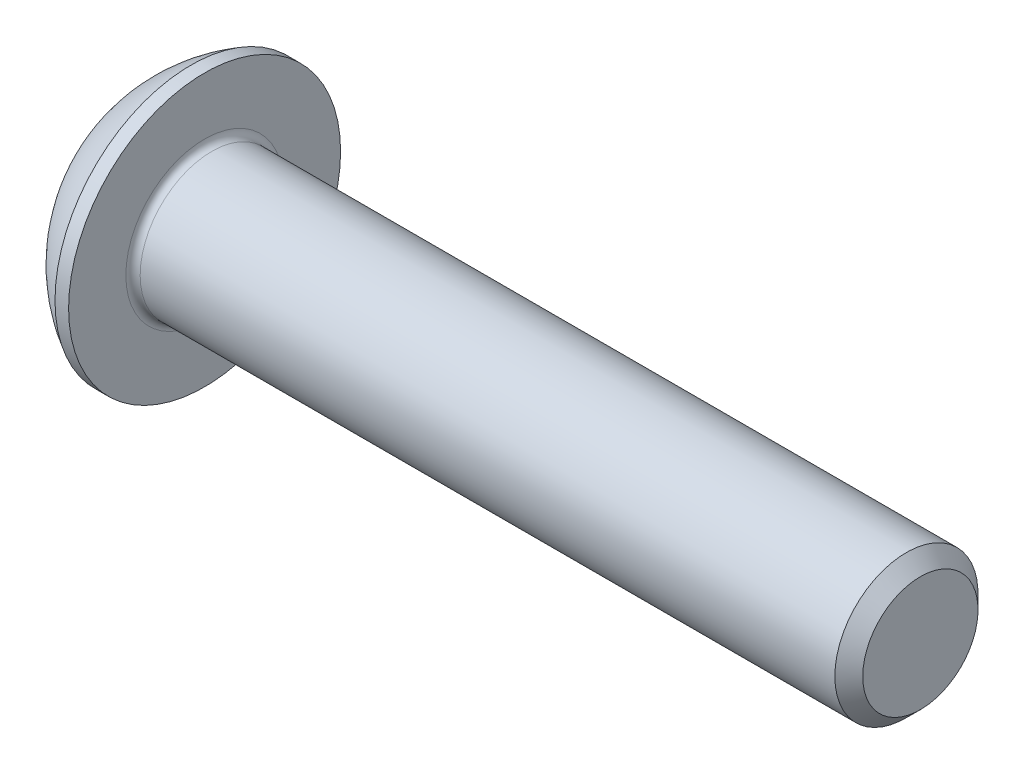
ISO-10303-21;
HEADER;
FILE_DESCRIPTION(('STEP AP214'),'2;1');
FILE_NAME('part.step','',(''),(''),'','','');
FILE_SCHEMA(('AUTOMOTIVE_DESIGN { 1 0 10303 214 1 1 1 1 }'));
ENDSEC;
DATA;
#1=APPLICATION_CONTEXT('core data for automotive mechanical design processes');
#2=APPLICATION_PROTOCOL_DEFINITION('international standard','automotive_design',2000,#1);
#3=PRODUCT_CONTEXT('',#1,'mechanical');
#4=PRODUCT('Part','Part','',(#3));
#5=PRODUCT_RELATED_PRODUCT_CATEGORY('part','',(#4));
#6=PRODUCT_DEFINITION_FORMATION('','',#4);
#7=PRODUCT_DEFINITION_CONTEXT('part definition',#1,'design');
#8=PRODUCT_DEFINITION('design','',#6,#7);
#9=PRODUCT_DEFINITION_SHAPE('','',#8);
#10=(LENGTH_UNIT() NAMED_UNIT(*) SI_UNIT(.MILLI.,.METRE.));
#11=(NAMED_UNIT(*) PLANE_ANGLE_UNIT() SI_UNIT($,.RADIAN.));
#12=(NAMED_UNIT(*) SI_UNIT($,.STERADIAN.) SOLID_ANGLE_UNIT());
#13=UNCERTAINTY_MEASURE_WITH_UNIT(LENGTH_MEASURE(1.E-05),#10,'distance_accuracy_value','');
#14=(GEOMETRIC_REPRESENTATION_CONTEXT(3) GLOBAL_UNCERTAINTY_ASSIGNED_CONTEXT((#13)) GLOBAL_UNIT_ASSIGNED_CONTEXT((#10,
#11,#12)) REPRESENTATION_CONTEXT('',''));
#15=CARTESIAN_POINT('',(0.,0.,0.));
#16=DIRECTION('',(0.,0.,1.));
#17=DIRECTION('',(1.,0.,0.));
#18=AXIS2_PLACEMENT_3D('',#15,#16,#17);
#19=CARTESIAN_POINT('',(0.,0.,0.));
#20=DIRECTION('',(-1.,0.,0.));
#21=DIRECTION('',(0.,0.,1.));
#22=AXIS2_PLACEMENT_3D('',#19,#20,#21);
#23=PLANE('',#22);
#24=CARTESIAN_POINT('',(0.,0.,0.));
#25=DIRECTION('',(-1.,0.,0.));
#26=DIRECTION('',(0.,0.,1.));
#27=AXIS2_PLACEMENT_3D('',#24,#25,#26);
#28=CIRCLE('',#27,1.9);
#29=CARTESIAN_POINT('',(0.,0.,1.9));
#30=VERTEX_POINT('',#29);
#31=EDGE_CURVE('E153',#30,#30,#28,.T.);
#32=ORIENTED_EDGE('',*,*,#31,.T.);
#33=EDGE_LOOP('',(#32));
#34=FACE_BOUND('',#33,.T.);
#35=DIRECTION('',(0.,-1.,0.));
#36=VECTOR('',#35,1.);
#37=CARTESIAN_POINT('',(0.,-0.721687836487032,1.25));
#38=LINE('',#37,#36);
#39=CARTESIAN_POINT('',(0.,0.721687836487034,1.25));
#40=VERTEX_POINT('',#39);
#41=CARTESIAN_POINT('',(0.,-0.721687836487032,1.25));
#42=VERTEX_POINT('',#41);
#43=EDGE_CURVE('E48',#40,#42,#38,.T.);
#44=ORIENTED_EDGE('',*,*,#43,.T.);
#45=DIRECTION('',(0.,-0.499999999999999,-0.866025403784439));
#46=VECTOR('',#45,1.);
#47=CARTESIAN_POINT('',(0.,-1.44337567297406,0.));
#48=LINE('',#47,#46);
#49=CARTESIAN_POINT('',(0.,-1.44337567297406,0.));
#50=VERTEX_POINT('',#49);
#51=EDGE_CURVE('E273',#42,#50,#48,.T.);
#52=ORIENTED_EDGE('',*,*,#51,.T.);
#53=DIRECTION('',(0.,0.499999999999999,-0.866025403784439));
#54=VECTOR('',#53,1.);
#55=CARTESIAN_POINT('',(0.,-0.721687836487033,-1.25));
#56=LINE('',#55,#54);
#57=CARTESIAN_POINT('',(0.,-0.721687836487033,-1.25));
#58=VERTEX_POINT('',#57);
#59=EDGE_CURVE('E128',#50,#58,#56,.T.);
#60=ORIENTED_EDGE('',*,*,#59,.T.);
#61=DIRECTION('',(0.,1.,0.));
#62=VECTOR('',#61,1.);
#63=CARTESIAN_POINT('',(0.,0.721687836487034,-1.25));
#64=LINE('',#63,#62);
#65=CARTESIAN_POINT('',(0.,0.721687836487034,-1.25));
#66=VERTEX_POINT('',#65);
#67=EDGE_CURVE('E276',#58,#66,#64,.T.);
#68=ORIENTED_EDGE('',*,*,#67,.T.);
#69=DIRECTION('',(0.,0.5,0.866025403784439));
#70=VECTOR('',#69,1.);
#71=CARTESIAN_POINT('',(0.,1.44337567297407,0.));
#72=LINE('',#71,#70);
#73=CARTESIAN_POINT('',(0.,1.44337567297407,0.));
#74=VERTEX_POINT('',#73);
#75=EDGE_CURVE('E278',#66,#74,#72,.T.);
#76=ORIENTED_EDGE('',*,*,#75,.T.);
#77=DIRECTION('',(0.,-0.499999999999999,0.866025403784439));
#78=VECTOR('',#77,1.);
#79=CARTESIAN_POINT('',(0.,0.721687836487034,1.25));
#80=LINE('',#79,#78);
#81=EDGE_CURVE('E280',#74,#40,#80,.T.);
#82=ORIENTED_EDGE('',*,*,#81,.T.);
#83=EDGE_LOOP('',(#44,#52,#60,#68,#76,#82));
#84=FACE_BOUND('',#83,.T.);
#85=ADVANCED_FACE('F33',(#34,#84),#23,.T.);
#86=CARTESIAN_POINT('',(3.88527472527473,0.,0.));
#87=DIRECTION('',(-1.,0.,0.));
#88=DIRECTION('',(0.,1.,0.));
#89=AXIS2_PLACEMENT_3D('',#86,#87,#88);
#90=SPHERICAL_SURFACE('',#89,4.32496932831421);
#91=CARTESIAN_POINT('',(1.82,0.,0.));
#92=DIRECTION('',(-1.,0.,0.));
#93=DIRECTION('',(0.,0.,1.));
#94=AXIS2_PLACEMENT_3D('',#91,#92,#93);
#95=CIRCLE('',#94,3.8);
#96=CARTESIAN_POINT('',(1.82,0.,3.8));
#97=VERTEX_POINT('',#96);
#98=EDGE_CURVE('E150',#97,#97,#95,.T.);
#99=ORIENTED_EDGE('',*,*,#98,.T.);
#100=EDGE_LOOP('',(#99));
#101=FACE_BOUND('',#100,.T.);
#102=ORIENTED_EDGE('',*,*,#31,.F.);
#103=EDGE_LOOP('',(#102));
#104=FACE_BOUND('',#103,.T.);
#105=ADVANCED_FACE('F174',(#101,#104),#90,.T.);
#106=CARTESIAN_POINT('',(0.,0.,0.));
#107=DIRECTION('',(-1.,0.,0.));
#108=DIRECTION('',(0.,0.,1.));
#109=AXIS2_PLACEMENT_3D('',#106,#107,#108);
#110=CYLINDRICAL_SURFACE('',#109,3.8);
#111=ORIENTED_EDGE('',*,*,#98,.F.);
#112=EDGE_LOOP('',(#111));
#113=FACE_BOUND('',#112,.T.);
#114=CARTESIAN_POINT('',(2.2,0.,0.));
#115=DIRECTION('',(-1.,0.,0.));
#116=DIRECTION('',(0.,0.,1.));
#117=AXIS2_PLACEMENT_3D('',#114,#115,#116);
#118=CIRCLE('',#117,3.8);
#119=CARTESIAN_POINT('',(2.2,0.,3.8));
#120=VERTEX_POINT('',#119);
#121=EDGE_CURVE('E147',#120,#120,#118,.T.);
#122=ORIENTED_EDGE('',*,*,#121,.T.);
#123=EDGE_LOOP('',(#122));
#124=FACE_BOUND('',#123,.T.);
#125=ADVANCED_FACE('F179',(#113,#124),#110,.T.);
#126=CARTESIAN_POINT('',(2.2,1.99999999999999,0.));
#127=DIRECTION('',(-1.,0.,0.));
#128=DIRECTION('',(0.,0.,1.));
#129=AXIS2_PLACEMENT_3D('',#126,#127,#128);
#130=PLANE('',#129);
#131=CARTESIAN_POINT('',(2.2,0.,0.));
#132=DIRECTION('',(-1.,0.,0.));
#133=DIRECTION('',(0.,0.,1.));
#134=AXIS2_PLACEMENT_3D('',#131,#132,#133);
#135=CIRCLE('',#134,2.2);
#136=CARTESIAN_POINT('',(2.2,0.,2.2));
#137=VERTEX_POINT('',#136);
#138=EDGE_CURVE('E41',#137,#137,#135,.T.);
#139=ORIENTED_EDGE('',*,*,#138,.T.);
#140=EDGE_LOOP('',(#139));
#141=FACE_BOUND('',#140,.T.);
#142=ORIENTED_EDGE('',*,*,#121,.F.);
#143=EDGE_LOOP('',(#142));
#144=FACE_BOUND('',#143,.T.);
#145=ADVANCED_FACE('F158',(#141,#144),#130,.F.);
#146=CARTESIAN_POINT('',(0.,0.,0.));
#147=DIRECTION('',(-1.,0.,0.));
#148=DIRECTION('',(0.,0.,1.));
#149=AXIS2_PLACEMENT_3D('',#146,#147,#148);
#150=CYLINDRICAL_SURFACE('',#149,2.);
#151=CARTESIAN_POINT('',(2.4,0.,0.));
#152=DIRECTION('',(-1.,0.,0.));
#153=DIRECTION('',(0.,0.,1.));
#154=AXIS2_PLACEMENT_3D('',#151,#152,#153);
#155=CIRCLE('',#154,2.);
#156=CARTESIAN_POINT('',(2.4,0.,2.));
#157=VERTEX_POINT('',#156);
#158=EDGE_CURVE('E11',#157,#157,#155,.F.);
#159=ORIENTED_EDGE('',*,*,#158,.T.);
#160=EDGE_LOOP('',(#159));
#161=FACE_BOUND('',#160,.T.);
#162=CARTESIAN_POINT('',(21.81,0.,0.));
#163=DIRECTION('',(-1.,0.,0.));
#164=DIRECTION('',(0.,0.,1.));
#165=AXIS2_PLACEMENT_3D('',#162,#163,#164);
#166=CIRCLE('',#165,2.);
#167=CARTESIAN_POINT('',(21.81,0.,2.));
#168=VERTEX_POINT('',#167);
#169=EDGE_CURVE('E144',#168,#168,#166,.T.);
#170=ORIENTED_EDGE('',*,*,#169,.T.);
#171=EDGE_LOOP('',(#170));
#172=FACE_BOUND('',#171,.T.);
#173=ADVANCED_FACE('F188',(#161,#172),#150,.T.);
#174=CARTESIAN_POINT('',(22.2,0.,0.));
#175=DIRECTION('',(-1.,0.,0.));
#176=DIRECTION('',(0.,0.,1.));
#177=AXIS2_PLACEMENT_3D('',#174,#175,#176);
#178=CONICAL_SURFACE('',#177,1.61,0.785398163397443);
#179=ORIENTED_EDGE('',*,*,#169,.F.);
#180=EDGE_LOOP('',(#179));
#181=FACE_BOUND('',#180,.T.);
#182=CARTESIAN_POINT('',(22.2,0.,0.));
#183=DIRECTION('',(-1.,0.,0.));
#184=DIRECTION('',(0.,0.,1.));
#185=AXIS2_PLACEMENT_3D('',#182,#183,#184);
#186=CIRCLE('',#185,1.61);
#187=CARTESIAN_POINT('',(22.2,0.,1.61));
#188=VERTEX_POINT('',#187);
#189=EDGE_CURVE('E140',#188,#188,#186,.T.);
#190=ORIENTED_EDGE('',*,*,#189,.T.);
#191=EDGE_LOOP('',(#190));
#192=FACE_BOUND('',#191,.T.);
#193=ADVANCED_FACE('F169',(#181,#192),#178,.T.);
#194=CARTESIAN_POINT('',(22.2,0.,0.));
#195=DIRECTION('',(-1.,0.,0.));
#196=DIRECTION('',(0.,0.,1.));
#197=AXIS2_PLACEMENT_3D('',#194,#195,#196);
#198=PLANE('',#197);
#199=ORIENTED_EDGE('',*,*,#189,.F.);
#200=EDGE_LOOP('',(#199));
#201=FACE_BOUND('',#200,.T.);
#202=ADVANCED_FACE('F162',(#201),#198,.F.);
#203=CARTESIAN_POINT('',(2.4,0.,0.));
#204=DIRECTION('',(-1.,0.,0.));
#205=DIRECTION('',(0.,0.,1.));
#206=AXIS2_PLACEMENT_3D('',#203,#204,#205);
#207=TOROIDAL_SURFACE('',#206,2.2,0.2);
#208=ORIENTED_EDGE('',*,*,#158,.F.);
#209=EDGE_LOOP('',(#208));
#210=FACE_BOUND('',#209,.T.);
#211=ORIENTED_EDGE('',*,*,#138,.F.);
#212=EDGE_LOOP('',(#211));
#213=FACE_BOUND('',#212,.T.);
#214=ADVANCED_FACE('F35',(#210,#213),#207,.F.);
#215=CARTESIAN_POINT('',(1.3,-1.44337567297406,0.));
#216=DIRECTION('',(0.,0.866025403784439,-0.499999999999999));
#217=DIRECTION('',(0.,0.499999999999999,0.866025403784439));
#218=AXIS2_PLACEMENT_3D('',#215,#216,#217);
#219=PLANE('',#218);
#220=DIRECTION('',(0.,-0.499999999999999,-0.866025403784439));
#221=VECTOR('',#220,1.);
#222=CARTESIAN_POINT('',(1.3,-1.44337567297406,0.));
#223=LINE('',#222,#221);
#224=CARTESIAN_POINT('',(1.3,-0.721687836487032,1.25));
#225=VERTEX_POINT('',#224);
#226=CARTESIAN_POINT('',(1.3,-1.08253175473055,0.624999999999999));
#227=VERTEX_POINT('',#226);
#228=EDGE_CURVE('E114',#225,#227,#223,.T.);
#229=ORIENTED_EDGE('',*,*,#228,.T.);
#230=CARTESIAN_POINT('',(1.3,-1.44337567297406,0.));
#231=VERTEX_POINT('',#230);
#232=EDGE_CURVE('E109',#227,#231,#223,.T.);
#233=ORIENTED_EDGE('',*,*,#232,.T.);
#234=DIRECTION('',(-1.,0.,0.));
#235=VECTOR('',#234,1.);
#236=CARTESIAN_POINT('',(1.3,-1.44337567297406,0.));
#237=LINE('',#236,#235);
#238=EDGE_CURVE('E111',#231,#50,#237,.T.);
#239=ORIENTED_EDGE('',*,*,#238,.T.);
#240=ORIENTED_EDGE('',*,*,#51,.F.);
#241=DIRECTION('',(-1.,0.,0.));
#242=VECTOR('',#241,1.);
#243=CARTESIAN_POINT('',(1.3,-0.721687836487032,1.25));
#244=LINE('',#243,#242);
#245=EDGE_CURVE('E269',#225,#42,#244,.T.);
#246=ORIENTED_EDGE('',*,*,#245,.F.);
#247=EDGE_LOOP('',(#229,#233,#239,#240,#246));
#248=FACE_BOUND('',#247,.T.);
#249=ADVANCED_FACE('F110',(#248),#219,.T.);
#250=CARTESIAN_POINT('',(1.3,-0.721687836487033,-1.25));
#251=DIRECTION('',(0.,0.866025403784439,0.499999999999999));
#252=DIRECTION('',(0.,-0.499999999999999,0.866025403784439));
#253=AXIS2_PLACEMENT_3D('',#250,#251,#252);
#254=PLANE('',#253);
#255=DIRECTION('',(0.,0.499999999999999,-0.866025403784439));
#256=VECTOR('',#255,1.);
#257=CARTESIAN_POINT('',(1.3,-0.721687836487033,-1.25));
#258=LINE('',#257,#256);
#259=CARTESIAN_POINT('',(1.3,-1.08253175473055,-0.624999999999999));
#260=VERTEX_POINT('',#259);
#261=EDGE_CURVE('E56',#231,#260,#258,.T.);
#262=ORIENTED_EDGE('',*,*,#261,.T.);
#263=CARTESIAN_POINT('',(1.3,-0.721687836487033,-1.25));
#264=VERTEX_POINT('',#263);
#265=EDGE_CURVE('E123',#260,#264,#258,.T.);
#266=ORIENTED_EDGE('',*,*,#265,.T.);
#267=DIRECTION('',(-1.,0.,0.));
#268=VECTOR('',#267,1.);
#269=CARTESIAN_POINT('',(1.3,-0.721687836487033,-1.25));
#270=LINE('',#269,#268);
#271=EDGE_CURVE('E130',#264,#58,#270,.T.);
#272=ORIENTED_EDGE('',*,*,#271,.T.);
#273=ORIENTED_EDGE('',*,*,#59,.F.);
#274=ORIENTED_EDGE('',*,*,#238,.F.);
#275=EDGE_LOOP('',(#262,#266,#272,#273,#274));
#276=FACE_BOUND('',#275,.T.);
#277=ADVANCED_FACE('F126',(#276),#254,.T.);
#278=CARTESIAN_POINT('',(1.3,0.721687836487034,-1.25));
#279=DIRECTION('',(0.,0.,1.));
#280=DIRECTION('',(1.,0.,0.));
#281=AXIS2_PLACEMENT_3D('',#278,#279,#280);
#282=PLANE('',#281);
#283=DIRECTION('',(0.,1.,0.));
#284=VECTOR('',#283,1.);
#285=CARTESIAN_POINT('',(1.3,0.721687836487034,-1.25));
#286=LINE('',#285,#284);
#287=CARTESIAN_POINT('',(1.3,0.,-1.25));
#288=VERTEX_POINT('',#287);
#289=EDGE_CURVE('E250',#264,#288,#286,.T.);
#290=ORIENTED_EDGE('',*,*,#289,.T.);
#291=CARTESIAN_POINT('',(1.3,0.721687836487034,-1.25));
#292=VERTEX_POINT('',#291);
#293=EDGE_CURVE('E122',#288,#292,#286,.T.);
#294=ORIENTED_EDGE('',*,*,#293,.T.);
#295=DIRECTION('',(-1.,0.,0.));
#296=VECTOR('',#295,1.);
#297=CARTESIAN_POINT('',(1.3,0.721687836487034,-1.25));
#298=LINE('',#297,#296);
#299=EDGE_CURVE('E135',#292,#66,#298,.T.);
#300=ORIENTED_EDGE('',*,*,#299,.T.);
#301=ORIENTED_EDGE('',*,*,#67,.F.);
#302=ORIENTED_EDGE('',*,*,#271,.F.);
#303=EDGE_LOOP('',(#290,#294,#300,#301,#302));
#304=FACE_BOUND('',#303,.T.);
#305=ADVANCED_FACE('F202',(#304),#282,.T.);
#306=CARTESIAN_POINT('',(1.3,1.44337567297407,0.));
#307=DIRECTION('',(0.,-0.866025403784439,0.5));
#308=DIRECTION('',(0.,-0.5,-0.866025403784439));
#309=AXIS2_PLACEMENT_3D('',#306,#307,#308);
#310=PLANE('',#309);
#311=DIRECTION('',(0.,0.5,0.866025403784439));
#312=VECTOR('',#311,1.);
#313=CARTESIAN_POINT('',(1.3,1.44337567297407,0.));
#314=LINE('',#313,#312);
#315=CARTESIAN_POINT('',(1.3,1.08253175473055,-0.625));
#316=VERTEX_POINT('',#315);
#317=EDGE_CURVE('E239',#292,#316,#314,.T.);
#318=ORIENTED_EDGE('',*,*,#317,.T.);
#319=CARTESIAN_POINT('',(1.3,1.44337567297407,0.));
#320=VERTEX_POINT('',#319);
#321=EDGE_CURVE('E244',#316,#320,#314,.T.);
#322=ORIENTED_EDGE('',*,*,#321,.T.);
#323=DIRECTION('',(-1.,0.,0.));
#324=VECTOR('',#323,1.);
#325=CARTESIAN_POINT('',(1.3,1.44337567297407,0.));
#326=LINE('',#325,#324);
#327=EDGE_CURVE('E284',#320,#74,#326,.T.);
#328=ORIENTED_EDGE('',*,*,#327,.T.);
#329=ORIENTED_EDGE('',*,*,#75,.F.);
#330=ORIENTED_EDGE('',*,*,#299,.F.);
#331=EDGE_LOOP('',(#318,#322,#328,#329,#330));
#332=FACE_BOUND('',#331,.T.);
#333=ADVANCED_FACE('F205',(#332),#310,.T.);
#334=CARTESIAN_POINT('',(1.3,0.721687836487034,1.25));
#335=DIRECTION('',(0.,-0.866025403784439,-0.499999999999999));
#336=DIRECTION('',(0.,0.499999999999999,-0.866025403784439));
#337=AXIS2_PLACEMENT_3D('',#334,#335,#336);
#338=PLANE('',#337);
#339=DIRECTION('',(0.,-0.499999999999999,0.866025403784439));
#340=VECTOR('',#339,1.);
#341=CARTESIAN_POINT('',(1.3,0.721687836487034,1.25));
#342=LINE('',#341,#340);
#343=CARTESIAN_POINT('',(1.3,1.08253175473055,0.625));
#344=VERTEX_POINT('',#343);
#345=EDGE_CURVE('E247',#320,#344,#342,.T.);
#346=ORIENTED_EDGE('',*,*,#345,.T.);
#347=CARTESIAN_POINT('',(1.3,0.721687836487034,1.25));
#348=VERTEX_POINT('',#347);
#349=EDGE_CURVE('E255',#344,#348,#342,.T.);
#350=ORIENTED_EDGE('',*,*,#349,.T.);
#351=DIRECTION('',(-1.,0.,0.));
#352=VECTOR('',#351,1.);
#353=CARTESIAN_POINT('',(1.3,0.721687836487034,1.25));
#354=LINE('',#353,#352);
#355=EDGE_CURVE('E268',#348,#40,#354,.T.);
#356=ORIENTED_EDGE('',*,*,#355,.T.);
#357=ORIENTED_EDGE('',*,*,#81,.F.);
#358=ORIENTED_EDGE('',*,*,#327,.F.);
#359=EDGE_LOOP('',(#346,#350,#356,#357,#358));
#360=FACE_BOUND('',#359,.T.);
#361=ADVANCED_FACE('F209',(#360),#338,.T.);
#362=CARTESIAN_POINT('',(1.3,-0.721687836487032,1.25));
#363=DIRECTION('',(0.,0.,-1.));
#364=DIRECTION('',(0.,1.,0.));
#365=AXIS2_PLACEMENT_3D('',#362,#363,#364);
#366=PLANE('',#365);
#367=DIRECTION('',(0.,-1.,0.));
#368=VECTOR('',#367,1.);
#369=CARTESIAN_POINT('',(1.3,-0.721687836487032,1.25));
#370=LINE('',#369,#368);
#371=CARTESIAN_POINT('',(1.3,0.,1.25));
#372=VERTEX_POINT('',#371);
#373=EDGE_CURVE('E261',#348,#372,#370,.T.);
#374=ORIENTED_EDGE('',*,*,#373,.T.);
#375=EDGE_CURVE('E263',#372,#225,#370,.T.);
#376=ORIENTED_EDGE('',*,*,#375,.T.);
#377=ORIENTED_EDGE('',*,*,#245,.T.);
#378=ORIENTED_EDGE('',*,*,#43,.F.);
#379=ORIENTED_EDGE('',*,*,#355,.F.);
#380=EDGE_LOOP('',(#374,#376,#377,#378,#379));
#381=FACE_BOUND('',#380,.T.);
#382=ADVANCED_FACE('F213',(#381),#366,.T.);
#383=CARTESIAN_POINT('',(1.3,-2.16506350946109,-1.25));
#384=DIRECTION('',(1.,0.,0.));
#385=DIRECTION('',(0.,0.,-1.));
#386=AXIS2_PLACEMENT_3D('',#383,#384,#385);
#387=PLANE('',#386);
#388=CARTESIAN_POINT('',(1.3,0.,0.));
#389=DIRECTION('',(-1.,0.,0.));
#390=DIRECTION('',(0.,0.,1.));
#391=AXIS2_PLACEMENT_3D('',#388,#389,#390);
#392=CIRCLE('',#391,1.25);
#393=EDGE_CURVE('E236',#316,#288,#392,.T.);
#394=ORIENTED_EDGE('',*,*,#393,.F.);
#395=ORIENTED_EDGE('',*,*,#317,.F.);
#396=ORIENTED_EDGE('',*,*,#293,.F.);
#397=EDGE_LOOP('',(#394,#395,#396));
#398=FACE_BOUND('',#397,.T.);
#399=ADVANCED_FACE('F217',(#398),#387,.F.);
#400=EDGE_CURVE('E141',#344,#316,#392,.T.);
#401=ORIENTED_EDGE('',*,*,#400,.F.);
#402=ORIENTED_EDGE('',*,*,#345,.F.);
#403=ORIENTED_EDGE('',*,*,#321,.F.);
#404=EDGE_LOOP('',(#401,#402,#403));
#405=FACE_BOUND('',#404,.T.);
#406=ADVANCED_FACE('F226',(#405),#387,.F.);
#407=EDGE_CURVE('E134',#372,#344,#392,.T.);
#408=ORIENTED_EDGE('',*,*,#407,.F.);
#409=ORIENTED_EDGE('',*,*,#373,.F.);
#410=ORIENTED_EDGE('',*,*,#349,.F.);
#411=EDGE_LOOP('',(#408,#409,#410));
#412=FACE_BOUND('',#411,.T.);
#413=ADVANCED_FACE('F231',(#412),#387,.F.);
#414=EDGE_CURVE('E129',#227,#372,#392,.T.);
#415=ORIENTED_EDGE('',*,*,#414,.F.);
#416=ORIENTED_EDGE('',*,*,#228,.F.);
#417=ORIENTED_EDGE('',*,*,#375,.F.);
#418=EDGE_LOOP('',(#415,#416,#417));
#419=FACE_BOUND('',#418,.T.);
#420=ADVANCED_FACE('F224',(#419),#387,.F.);
#421=EDGE_CURVE('E120',#260,#227,#392,.T.);
#422=ORIENTED_EDGE('',*,*,#421,.F.);
#423=ORIENTED_EDGE('',*,*,#261,.F.);
#424=ORIENTED_EDGE('',*,*,#232,.F.);
#425=EDGE_LOOP('',(#422,#423,#424));
#426=FACE_BOUND('',#425,.T.);
#427=ADVANCED_FACE('F119',(#426),#387,.F.);
#428=EDGE_CURVE('E242',#288,#260,#392,.T.);
#429=ORIENTED_EDGE('',*,*,#428,.F.);
#430=ORIENTED_EDGE('',*,*,#289,.F.);
#431=ORIENTED_EDGE('',*,*,#265,.F.);
#432=EDGE_LOOP('',(#429,#430,#431));
#433=FACE_BOUND('',#432,.T.);
#434=ADVANCED_FACE('F197',(#433),#387,.F.);
#435=CARTESIAN_POINT('',(2.02168783648704,0.,0.));
#436=DIRECTION('',(-1.,0.,0.));
#437=DIRECTION('',(0.,0.,1.));
#438=AXIS2_PLACEMENT_3D('',#435,#436,#437);
#439=CONICAL_SURFACE('',#438,0.,1.04719755119659);
#440=ORIENTED_EDGE('',*,*,#407,.T.);
#441=ORIENTED_EDGE('',*,*,#400,.T.);
#442=ORIENTED_EDGE('',*,*,#393,.T.);
#443=ORIENTED_EDGE('',*,*,#428,.T.);
#444=ORIENTED_EDGE('',*,*,#421,.T.);
#445=ORIENTED_EDGE('',*,*,#414,.T.);
#446=EDGE_LOOP('',(#440,#441,#442,#443,#444,#445));
#447=FACE_BOUND('',#446,.T.);
#448=CARTESIAN_POINT('',(2.02168783648704,0.,0.));
#449=VERTEX_POINT('',#448);
#450=VERTEX_LOOP('',#449);
#451=FACE_BOUND('',#450,.T.);
#452=ADVANCED_FACE('F195',(#447,#451),#439,.F.);
#453=CLOSED_SHELL('',(#85,#105,#125,#145,#173,#193,#202,#214,#249,#277,#305,#333,#361,#382,#399,
#406,#413,#420,#427,#434,#452));
#454=MANIFOLD_SOLID_BREP('B2',#453);
#455=ADVANCED_BREP_SHAPE_REPRESENTATION('',(#18,#454),#14);
#456=SHAPE_DEFINITION_REPRESENTATION(#9,#455);
ENDSEC;
END-ISO-10303-21;
